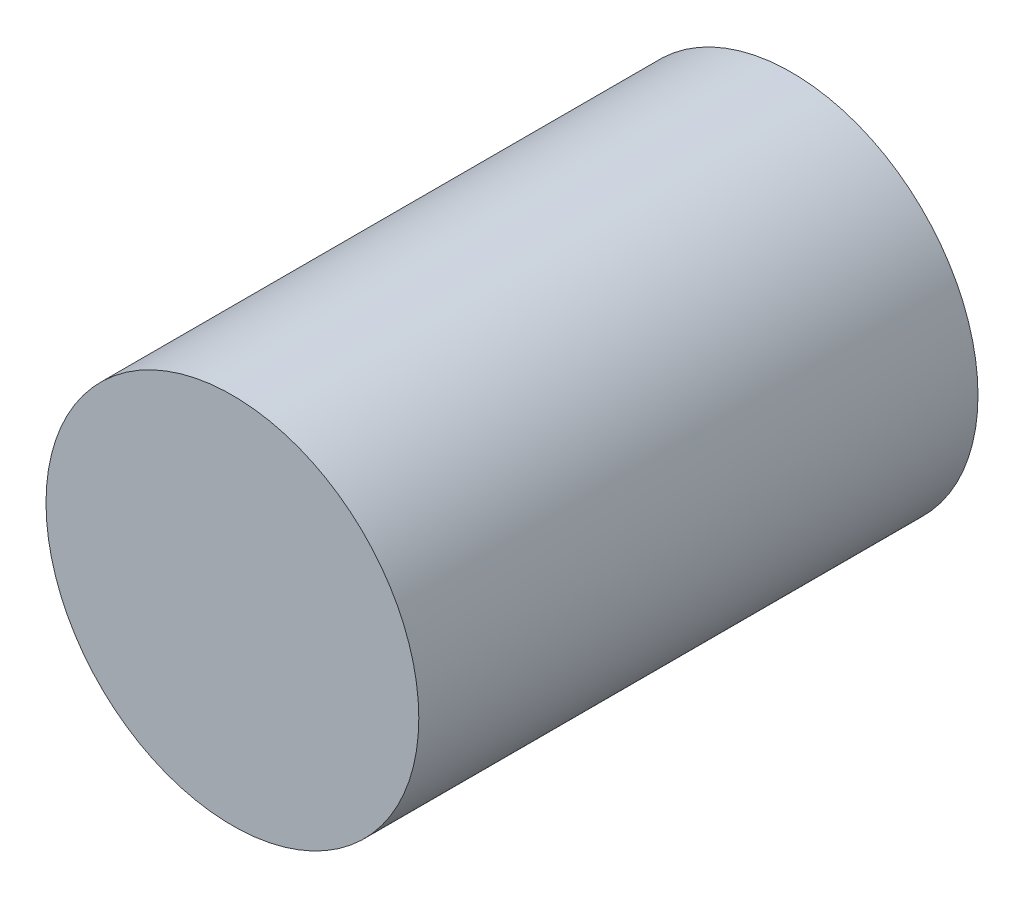
ISO-10303-21;
HEADER;
FILE_DESCRIPTION(('STEP AP214'),'2;1');
FILE_NAME('part.step','',(''),(''),'','','');
FILE_SCHEMA(('AUTOMOTIVE_DESIGN { 1 0 10303 214 1 1 1 1 }'));
ENDSEC;
DATA;
#1=APPLICATION_CONTEXT('core data for automotive mechanical design processes');
#2=APPLICATION_PROTOCOL_DEFINITION('international standard','automotive_design',2000,#1);
#3=PRODUCT_CONTEXT('',#1,'mechanical');
#4=PRODUCT('Part','Part','',(#3));
#5=PRODUCT_RELATED_PRODUCT_CATEGORY('part','',(#4));
#6=PRODUCT_DEFINITION_FORMATION('','',#4);
#7=PRODUCT_DEFINITION_CONTEXT('part definition',#1,'design');
#8=PRODUCT_DEFINITION('design','',#6,#7);
#9=PRODUCT_DEFINITION_SHAPE('','',#8);
#10=(LENGTH_UNIT() NAMED_UNIT(*) SI_UNIT(.MILLI.,.METRE.));
#11=(NAMED_UNIT(*) PLANE_ANGLE_UNIT() SI_UNIT($,.RADIAN.));
#12=(NAMED_UNIT(*) SI_UNIT($,.STERADIAN.) SOLID_ANGLE_UNIT());
#13=UNCERTAINTY_MEASURE_WITH_UNIT(LENGTH_MEASURE(1.E-05),#10,'distance_accuracy_value','');
#14=(GEOMETRIC_REPRESENTATION_CONTEXT(3) GLOBAL_UNCERTAINTY_ASSIGNED_CONTEXT((#13)) GLOBAL_UNIT_ASSIGNED_CONTEXT((#10,
#11,#12)) REPRESENTATION_CONTEXT('',''));
#15=CARTESIAN_POINT('',(0.,0.,0.));
#16=DIRECTION('',(0.,0.,1.));
#17=DIRECTION('',(1.,0.,0.));
#18=AXIS2_PLACEMENT_3D('',#15,#16,#17);
#19=CARTESIAN_POINT('',(-9.52690315849783,14.0101517036733,15.24));
#20=DIRECTION('',(0.,0.,-1.));
#21=DIRECTION('',(-1.,0.,0.));
#22=AXIS2_PLACEMENT_3D('',#19,#20,#21);
#23=CYLINDRICAL_SURFACE('',#22,5.08);
#24=CARTESIAN_POINT('',(-9.52690315849783,14.0101517036733,15.24));
#25=DIRECTION('',(0.,0.,1.));
#26=DIRECTION('',(1.,0.,0.));
#27=AXIS2_PLACEMENT_3D('',#24,#25,#26);
#28=CIRCLE('',#27,5.08);
#29=CARTESIAN_POINT('',(-4.44690315849783,14.0101517036733,15.24));
#30=VERTEX_POINT('',#29);
#31=EDGE_CURVE('E10',#30,#30,#28,.T.);
#32=ORIENTED_EDGE('',*,*,#31,.F.);
#33=EDGE_LOOP('',(#32));
#34=FACE_BOUND('',#33,.T.);
#35=CARTESIAN_POINT('',(-9.52690315849783,14.0101517036733,0.));
#36=DIRECTION('',(0.,0.,1.));
#37=DIRECTION('',(1.,0.,0.));
#38=AXIS2_PLACEMENT_3D('',#35,#36,#37);
#39=CIRCLE('',#38,5.08);
#40=CARTESIAN_POINT('',(-4.44690315849783,14.0101517036733,0.));
#41=VERTEX_POINT('',#40);
#42=EDGE_CURVE('E34',#41,#41,#39,.T.);
#43=ORIENTED_EDGE('',*,*,#42,.T.);
#44=EDGE_LOOP('',(#43));
#45=FACE_BOUND('',#44,.T.);
#46=ADVANCED_FACE('F31',(#34,#45),#23,.T.);
#47=CARTESIAN_POINT('',(-9.52690315849783,14.0101517036733,15.24));
#48=DIRECTION('',(0.,0.,1.));
#49=DIRECTION('',(1.,0.,0.));
#50=AXIS2_PLACEMENT_3D('',#47,#48,#49);
#51=PLANE('',#50);
#52=ORIENTED_EDGE('',*,*,#31,.T.);
#53=EDGE_LOOP('',(#52));
#54=FACE_BOUND('',#53,.T.);
#55=ADVANCED_FACE('F46',(#54),#51,.T.);
#56=CARTESIAN_POINT('',(-9.52690315849783,14.0101517036733,0.));
#57=DIRECTION('',(0.,0.,1.));
#58=DIRECTION('',(1.,0.,0.));
#59=AXIS2_PLACEMENT_3D('',#56,#57,#58);
#60=PLANE('',#59);
#61=ORIENTED_EDGE('',*,*,#42,.F.);
#62=EDGE_LOOP('',(#61));
#63=FACE_BOUND('',#62,.T.);
#64=ADVANCED_FACE('F44',(#63),#60,.F.);
#65=CLOSED_SHELL('',(#46,#55,#64));
#66=MANIFOLD_SOLID_BREP('B2',#65);
#67=ADVANCED_BREP_SHAPE_REPRESENTATION('',(#18,#66),#14);
#68=SHAPE_DEFINITION_REPRESENTATION(#9,#67);
ENDSEC;
END-ISO-10303-21;
